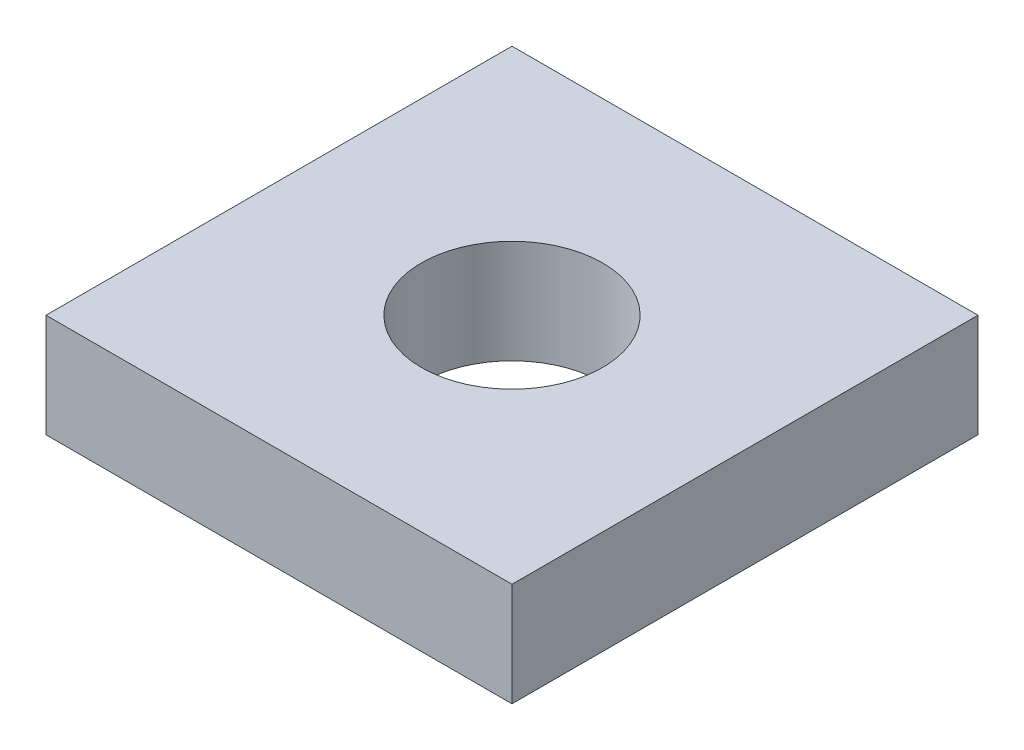
ISO-10303-21;
HEADER;
FILE_DESCRIPTION(('STEP AP214'),'2;1');
FILE_NAME('part.step','',(''),(''),'','','');
FILE_SCHEMA(('AUTOMOTIVE_DESIGN { 1 0 10303 214 1 1 1 1 }'));
ENDSEC;
DATA;
#1=APPLICATION_CONTEXT('core data for automotive mechanical design processes');
#2=APPLICATION_PROTOCOL_DEFINITION('international standard','automotive_design',2000,#1);
#3=PRODUCT_CONTEXT('',#1,'mechanical');
#4=PRODUCT('Part','Part','',(#3));
#5=PRODUCT_RELATED_PRODUCT_CATEGORY('part','',(#4));
#6=PRODUCT_DEFINITION_FORMATION('','',#4);
#7=PRODUCT_DEFINITION_CONTEXT('part definition',#1,'design');
#8=PRODUCT_DEFINITION('design','',#6,#7);
#9=PRODUCT_DEFINITION_SHAPE('','',#8);
#10=(LENGTH_UNIT() NAMED_UNIT(*) SI_UNIT(.MILLI.,.METRE.));
#11=(NAMED_UNIT(*) PLANE_ANGLE_UNIT() SI_UNIT($,.RADIAN.));
#12=(NAMED_UNIT(*) SI_UNIT($,.STERADIAN.) SOLID_ANGLE_UNIT());
#13=UNCERTAINTY_MEASURE_WITH_UNIT(LENGTH_MEASURE(1.E-05),#10,'distance_accuracy_value','');
#14=(GEOMETRIC_REPRESENTATION_CONTEXT(3) GLOBAL_UNCERTAINTY_ASSIGNED_CONTEXT((#13)) GLOBAL_UNIT_ASSIGNED_CONTEXT((#10,
#11,#12)) REPRESENTATION_CONTEXT('',''));
#15=CARTESIAN_POINT('',(0.,0.,0.));
#16=DIRECTION('',(0.,0.,1.));
#17=DIRECTION('',(1.,0.,0.));
#18=AXIS2_PLACEMENT_3D('',#15,#16,#17);
#19=CARTESIAN_POINT('',(-9.,2.,-9.));
#20=DIRECTION('',(1.,0.,0.));
#21=DIRECTION('',(0.,0.,-1.));
#22=AXIS2_PLACEMENT_3D('',#19,#20,#21);
#23=PLANE('',#22);
#24=DIRECTION('',(0.,0.,1.));
#25=VECTOR('',#24,1.);
#26=CARTESIAN_POINT('',(-9.,-2.,-9.));
#27=LINE('',#26,#25);
#28=CARTESIAN_POINT('',(-9.,-2.,-9.));
#29=VERTEX_POINT('',#28);
#30=CARTESIAN_POINT('',(-9.,-2.,9.));
#31=VERTEX_POINT('',#30);
#32=EDGE_CURVE('E79',#29,#31,#27,.T.);
#33=ORIENTED_EDGE('',*,*,#32,.T.);
#34=DIRECTION('',(0.,-1.,0.));
#35=VECTOR('',#34,1.);
#36=CARTESIAN_POINT('',(-9.,2.,9.));
#37=LINE('',#36,#35);
#38=CARTESIAN_POINT('',(-9.,2.,9.));
#39=VERTEX_POINT('',#38);
#40=EDGE_CURVE('E10',#39,#31,#37,.T.);
#41=ORIENTED_EDGE('',*,*,#40,.F.);
#42=DIRECTION('',(0.,0.,1.));
#43=VECTOR('',#42,1.);
#44=CARTESIAN_POINT('',(-9.,2.,-9.));
#45=LINE('',#44,#43);
#46=CARTESIAN_POINT('',(-9.,2.,-9.));
#47=VERTEX_POINT('',#46);
#48=EDGE_CURVE('E67',#47,#39,#45,.T.);
#49=ORIENTED_EDGE('',*,*,#48,.F.);
#50=DIRECTION('',(0.,-1.,0.));
#51=VECTOR('',#50,1.);
#52=CARTESIAN_POINT('',(-9.,2.,-9.));
#53=LINE('',#52,#51);
#54=EDGE_CURVE('E75',#47,#29,#53,.T.);
#55=ORIENTED_EDGE('',*,*,#54,.T.);
#56=EDGE_LOOP('',(#33,#41,#49,#55));
#57=FACE_BOUND('',#56,.T.);
#58=ADVANCED_FACE('F16',(#57),#23,.F.);
#59=CARTESIAN_POINT('',(-9.,2.,9.));
#60=DIRECTION('',(0.,0.,-1.));
#61=DIRECTION('',(-1.,0.,0.));
#62=AXIS2_PLACEMENT_3D('',#59,#60,#61);
#63=PLANE('',#62);
#64=DIRECTION('',(1.,0.,0.));
#65=VECTOR('',#64,1.);
#66=CARTESIAN_POINT('',(-9.,-2.,9.));
#67=LINE('',#66,#65);
#68=CARTESIAN_POINT('',(9.00000000000001,-2.,9.));
#69=VERTEX_POINT('',#68);
#70=EDGE_CURVE('E71',#31,#69,#67,.T.);
#71=ORIENTED_EDGE('',*,*,#70,.T.);
#72=DIRECTION('',(0.,-1.,0.));
#73=VECTOR('',#72,1.);
#74=CARTESIAN_POINT('',(9.00000000000001,2.,9.));
#75=LINE('',#74,#73);
#76=CARTESIAN_POINT('',(9.00000000000001,2.,9.));
#77=VERTEX_POINT('',#76);
#78=EDGE_CURVE('E24',#77,#69,#75,.T.);
#79=ORIENTED_EDGE('',*,*,#78,.F.);
#80=DIRECTION('',(1.,0.,0.));
#81=VECTOR('',#80,1.);
#82=CARTESIAN_POINT('',(-9.,2.,9.));
#83=LINE('',#82,#81);
#84=EDGE_CURVE('E62',#39,#77,#83,.T.);
#85=ORIENTED_EDGE('',*,*,#84,.F.);
#86=ORIENTED_EDGE('',*,*,#40,.T.);
#87=EDGE_LOOP('',(#71,#79,#85,#86));
#88=FACE_BOUND('',#87,.T.);
#89=ADVANCED_FACE('F70',(#88),#63,.F.);
#90=CARTESIAN_POINT('',(9.,2.,-9.));
#91=DIRECTION('',(-1.,0.,0.));
#92=DIRECTION('',(0.,0.,1.));
#93=AXIS2_PLACEMENT_3D('',#90,#91,#92);
#94=PLANE('',#93);
#95=DIRECTION('',(0.,0.,-1.));
#96=VECTOR('',#95,1.);
#97=CARTESIAN_POINT('',(9.,-2.,-9.));
#98=LINE('',#97,#96);
#99=CARTESIAN_POINT('',(9.,-2.,-9.));
#100=VERTEX_POINT('',#99);
#101=EDGE_CURVE('E49',#69,#100,#98,.T.);
#102=ORIENTED_EDGE('',*,*,#101,.T.);
#103=DIRECTION('',(0.,-1.,0.));
#104=VECTOR('',#103,1.);
#105=CARTESIAN_POINT('',(9.,2.,-9.));
#106=LINE('',#105,#104);
#107=CARTESIAN_POINT('',(9.,2.,-9.));
#108=VERTEX_POINT('',#107);
#109=EDGE_CURVE('E72',#108,#100,#106,.T.);
#110=ORIENTED_EDGE('',*,*,#109,.F.);
#111=DIRECTION('',(0.,0.,-1.));
#112=VECTOR('',#111,1.);
#113=CARTESIAN_POINT('',(9.,2.,-9.));
#114=LINE('',#113,#112);
#115=EDGE_CURVE('E65',#77,#108,#114,.T.);
#116=ORIENTED_EDGE('',*,*,#115,.F.);
#117=ORIENTED_EDGE('',*,*,#78,.T.);
#118=EDGE_LOOP('',(#102,#110,#116,#117));
#119=FACE_BOUND('',#118,.T.);
#120=ADVANCED_FACE('F73',(#119),#94,.F.);
#121=CARTESIAN_POINT('',(-9.,2.,-9.));
#122=DIRECTION('',(0.,0.,1.));
#123=DIRECTION('',(1.,0.,0.));
#124=AXIS2_PLACEMENT_3D('',#121,#122,#123);
#125=PLANE('',#124);
#126=DIRECTION('',(-1.,0.,0.));
#127=VECTOR('',#126,1.);
#128=CARTESIAN_POINT('',(-9.,-2.,-9.));
#129=LINE('',#128,#127);
#130=EDGE_CURVE('E55',#100,#29,#129,.T.);
#131=ORIENTED_EDGE('',*,*,#130,.T.);
#132=ORIENTED_EDGE('',*,*,#54,.F.);
#133=DIRECTION('',(-1.,0.,0.));
#134=VECTOR('',#133,1.);
#135=CARTESIAN_POINT('',(-9.,2.,-9.));
#136=LINE('',#135,#134);
#137=EDGE_CURVE('E32',#108,#47,#136,.T.);
#138=ORIENTED_EDGE('',*,*,#137,.F.);
#139=ORIENTED_EDGE('',*,*,#109,.T.);
#140=EDGE_LOOP('',(#131,#132,#138,#139));
#141=FACE_BOUND('',#140,.T.);
#142=ADVANCED_FACE('F87',(#141),#125,.F.);
#143=CARTESIAN_POINT('',(0.,2.,0.));
#144=DIRECTION('',(0.,1.,0.));
#145=DIRECTION('',(0.,0.,1.));
#146=AXIS2_PLACEMENT_3D('',#143,#144,#145);
#147=PLANE('',#146);
#148=CARTESIAN_POINT('',(0.,2.,0.));
#149=DIRECTION('',(0.,1.,0.));
#150=DIRECTION('',(0.,0.,1.));
#151=AXIS2_PLACEMENT_3D('',#148,#149,#150);
#152=CIRCLE('',#151,3.5);
#153=CARTESIAN_POINT('',(0.,2.,3.5));
#154=VERTEX_POINT('',#153);
#155=EDGE_CURVE('E93',#154,#154,#152,.T.);
#156=ORIENTED_EDGE('',*,*,#155,.F.);
#157=EDGE_LOOP('',(#156));
#158=FACE_BOUND('',#157,.T.);
#159=ORIENTED_EDGE('',*,*,#48,.T.);
#160=ORIENTED_EDGE('',*,*,#84,.T.);
#161=ORIENTED_EDGE('',*,*,#115,.T.);
#162=ORIENTED_EDGE('',*,*,#137,.T.);
#163=EDGE_LOOP('',(#159,#160,#161,#162));
#164=FACE_BOUND('',#163,.T.);
#165=ADVANCED_FACE('F63',(#158,#164),#147,.T.);
#166=CARTESIAN_POINT('',(0.,-2.,0.));
#167=DIRECTION('',(0.,1.,0.));
#168=DIRECTION('',(0.,0.,1.));
#169=AXIS2_PLACEMENT_3D('',#166,#167,#168);
#170=PLANE('',#169);
#171=CARTESIAN_POINT('',(0.,-2.,0.));
#172=DIRECTION('',(0.,1.,0.));
#173=DIRECTION('',(0.,0.,1.));
#174=AXIS2_PLACEMENT_3D('',#171,#172,#173);
#175=CIRCLE('',#174,3.5);
#176=CARTESIAN_POINT('',(0.,-2.,3.5));
#177=VERTEX_POINT('',#176);
#178=EDGE_CURVE('E82',#177,#177,#175,.T.);
#179=ORIENTED_EDGE('',*,*,#178,.T.);
#180=EDGE_LOOP('',(#179));
#181=FACE_BOUND('',#180,.T.);
#182=ORIENTED_EDGE('',*,*,#32,.F.);
#183=ORIENTED_EDGE('',*,*,#130,.F.);
#184=ORIENTED_EDGE('',*,*,#101,.F.);
#185=ORIENTED_EDGE('',*,*,#70,.F.);
#186=EDGE_LOOP('',(#182,#183,#184,#185));
#187=FACE_BOUND('',#186,.T.);
#188=ADVANCED_FACE('F90',(#181,#187),#170,.F.);
#189=CARTESIAN_POINT('',(0.,-2.,0.));
#190=DIRECTION('',(0.,1.,0.));
#191=DIRECTION('',(0.,0.,1.));
#192=AXIS2_PLACEMENT_3D('',#189,#190,#191);
#193=CYLINDRICAL_SURFACE('',#192,3.5);
#194=ORIENTED_EDGE('',*,*,#178,.F.);
#195=EDGE_LOOP('',(#194));
#196=FACE_BOUND('',#195,.T.);
#197=ORIENTED_EDGE('',*,*,#155,.T.);
#198=EDGE_LOOP('',(#197));
#199=FACE_BOUND('',#198,.T.);
#200=ADVANCED_FACE('F100',(#196,#199),#193,.F.);
#201=CLOSED_SHELL('',(#58,#89,#120,#142,#165,#188,#200));
#202=MANIFOLD_SOLID_BREP('B1',#201);
#203=ADVANCED_BREP_SHAPE_REPRESENTATION('',(#18,#202),#14);
#204=SHAPE_DEFINITION_REPRESENTATION(#9,#203);
ENDSEC;
END-ISO-10303-21;
